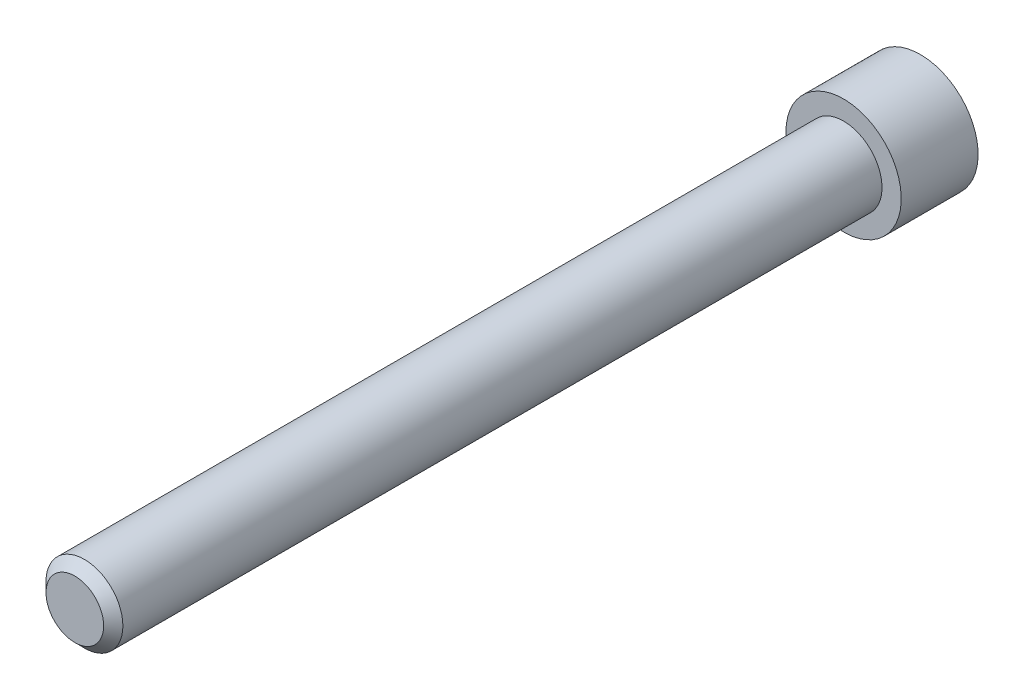
ISO-10303-21;
HEADER;
FILE_DESCRIPTION(('STEP AP214'),'2;1');
FILE_NAME('part.step','',(''),(''),'','','');
FILE_SCHEMA(('AUTOMOTIVE_DESIGN { 1 0 10303 214 1 1 1 1 }'));
ENDSEC;
DATA;
#1=APPLICATION_CONTEXT('core data for automotive mechanical design processes');
#2=APPLICATION_PROTOCOL_DEFINITION('international standard','automotive_design',2000,#1);
#3=PRODUCT_CONTEXT('',#1,'mechanical');
#4=PRODUCT('Part','Part','',(#3));
#5=PRODUCT_RELATED_PRODUCT_CATEGORY('part','',(#4));
#6=PRODUCT_DEFINITION_FORMATION('','',#4);
#7=PRODUCT_DEFINITION_CONTEXT('part definition',#1,'design');
#8=PRODUCT_DEFINITION('design','',#6,#7);
#9=PRODUCT_DEFINITION_SHAPE('','',#8);
#10=(LENGTH_UNIT() NAMED_UNIT(*) SI_UNIT(.MILLI.,.METRE.));
#11=(NAMED_UNIT(*) PLANE_ANGLE_UNIT() SI_UNIT($,.RADIAN.));
#12=(NAMED_UNIT(*) SI_UNIT($,.STERADIAN.) SOLID_ANGLE_UNIT());
#13=UNCERTAINTY_MEASURE_WITH_UNIT(LENGTH_MEASURE(1.E-05),#10,'distance_accuracy_value','');
#14=(GEOMETRIC_REPRESENTATION_CONTEXT(3) GLOBAL_UNCERTAINTY_ASSIGNED_CONTEXT((#13)) GLOBAL_UNIT_ASSIGNED_CONTEXT((#10,
#11,#12)) REPRESENTATION_CONTEXT('',''));
#15=CARTESIAN_POINT('',(0.,0.,0.));
#16=DIRECTION('',(0.,0.,1.));
#17=DIRECTION('',(1.,0.,0.));
#18=AXIS2_PLACEMENT_3D('',#15,#16,#17);
#19=CARTESIAN_POINT('',(0.,0.,200.));
#20=DIRECTION('',(0.,0.,-1.));
#21=DIRECTION('',(-1.,0.,0.));
#22=AXIS2_PLACEMENT_3D('',#19,#20,#21);
#23=CYLINDRICAL_SURFACE('',#22,10.);
#24=CARTESIAN_POINT('',(0.,0.,197.5));
#25=DIRECTION('',(0.,0.,1.));
#26=DIRECTION('',(1.,0.,0.));
#27=AXIS2_PLACEMENT_3D('',#24,#25,#26);
#28=CIRCLE('',#27,10.);
#29=CARTESIAN_POINT('',(10.,0.,197.5));
#30=VERTEX_POINT('',#29);
#31=EDGE_CURVE('E10',#30,#30,#28,.F.);
#32=ORIENTED_EDGE('',*,*,#31,.T.);
#33=EDGE_LOOP('',(#32));
#34=FACE_BOUND('',#33,.T.);
#35=CARTESIAN_POINT('',(0.,0.,0.));
#36=DIRECTION('',(0.,0.,-1.));
#37=DIRECTION('',(-1.,0.,0.));
#38=AXIS2_PLACEMENT_3D('',#35,#36,#37);
#39=CIRCLE('',#38,10.);
#40=CARTESIAN_POINT('',(-10.,0.,0.));
#41=VERTEX_POINT('',#40);
#42=EDGE_CURVE('E49',#41,#41,#39,.T.);
#43=ORIENTED_EDGE('',*,*,#42,.F.);
#44=EDGE_LOOP('',(#43));
#45=FACE_BOUND('',#44,.T.);
#46=ADVANCED_FACE('F38',(#34,#45),#23,.T.);
#47=CARTESIAN_POINT('',(0.,0.,200.));
#48=DIRECTION('',(0.,0.,1.));
#49=DIRECTION('',(1.,0.,0.));
#50=AXIS2_PLACEMENT_3D('',#47,#48,#49);
#51=PLANE('',#50);
#52=CARTESIAN_POINT('',(0.,0.,200.));
#53=DIRECTION('',(0.,0.,1.));
#54=DIRECTION('',(1.,0.,0.));
#55=AXIS2_PLACEMENT_3D('',#52,#53,#54);
#56=CIRCLE('',#55,7.5);
#57=CARTESIAN_POINT('',(7.5,0.,200.));
#58=VERTEX_POINT('',#57);
#59=EDGE_CURVE('E45',#58,#58,#56,.T.);
#60=ORIENTED_EDGE('',*,*,#59,.T.);
#61=EDGE_LOOP('',(#60));
#62=FACE_BOUND('',#61,.T.);
#63=ADVANCED_FACE('F73',(#62),#51,.T.);
#64=CARTESIAN_POINT('',(0.,0.,0.));
#65=DIRECTION('',(0.,0.,-1.));
#66=DIRECTION('',(-1.,0.,0.));
#67=AXIS2_PLACEMENT_3D('',#64,#65,#66);
#68=PLANE('',#67);
#69=CARTESIAN_POINT('',(0.,0.,0.));
#70=DIRECTION('',(0.,0.,-1.));
#71=DIRECTION('',(-1.,0.,0.));
#72=AXIS2_PLACEMENT_3D('',#69,#70,#71);
#73=CIRCLE('',#72,15.);
#74=CARTESIAN_POINT('',(-15.,0.,0.));
#75=VERTEX_POINT('',#74);
#76=EDGE_CURVE('E56',#75,#75,#73,.T.);
#77=ORIENTED_EDGE('',*,*,#76,.F.);
#78=EDGE_LOOP('',(#77));
#79=FACE_BOUND('',#78,.T.);
#80=ORIENTED_EDGE('',*,*,#42,.T.);
#81=EDGE_LOOP('',(#80));
#82=FACE_BOUND('',#81,.T.);
#83=ADVANCED_FACE('F67',(#79,#82),#68,.F.);
#84=CARTESIAN_POINT('',(0.,0.,-20.));
#85=DIRECTION('',(0.,0.,1.));
#86=DIRECTION('',(1.,0.,0.));
#87=AXIS2_PLACEMENT_3D('',#84,#85,#86);
#88=CYLINDRICAL_SURFACE('',#87,15.);
#89=CARTESIAN_POINT('',(0.,0.,-20.));
#90=DIRECTION('',(0.,0.,-1.));
#91=DIRECTION('',(-1.,0.,0.));
#92=AXIS2_PLACEMENT_3D('',#89,#90,#91);
#93=CIRCLE('',#92,15.);
#94=CARTESIAN_POINT('',(-15.,0.,-20.));
#95=VERTEX_POINT('',#94);
#96=EDGE_CURVE('E53',#95,#95,#93,.T.);
#97=ORIENTED_EDGE('',*,*,#96,.F.);
#98=EDGE_LOOP('',(#97));
#99=FACE_BOUND('',#98,.T.);
#100=ORIENTED_EDGE('',*,*,#76,.T.);
#101=EDGE_LOOP('',(#100));
#102=FACE_BOUND('',#101,.T.);
#103=ADVANCED_FACE('F64',(#99,#102),#88,.T.);
#104=CARTESIAN_POINT('',(0.,0.,-20.));
#105=DIRECTION('',(0.,0.,-1.));
#106=DIRECTION('',(-1.,0.,0.));
#107=AXIS2_PLACEMENT_3D('',#104,#105,#106);
#108=PLANE('',#107);
#109=ORIENTED_EDGE('',*,*,#96,.T.);
#110=EDGE_LOOP('',(#109));
#111=FACE_BOUND('',#110,.T.);
#112=ADVANCED_FACE('F62',(#111),#108,.T.);
#113=CARTESIAN_POINT('',(0.,0.,200.));
#114=DIRECTION('',(0.,0.,-1.));
#115=DIRECTION('',(-1.,0.,0.));
#116=AXIS2_PLACEMENT_3D('',#113,#114,#115);
#117=CONICAL_SURFACE('',#116,7.5,0.785398163397449);
#118=ORIENTED_EDGE('',*,*,#31,.F.);
#119=EDGE_LOOP('',(#118));
#120=FACE_BOUND('',#119,.T.);
#121=ORIENTED_EDGE('',*,*,#59,.F.);
#122=EDGE_LOOP('',(#121));
#123=FACE_BOUND('',#122,.T.);
#124=ADVANCED_FACE('F40',(#120,#123),#117,.T.);
#125=CLOSED_SHELL('',(#46,#63,#83,#103,#112,#124));
#126=MANIFOLD_SOLID_BREP('B2',#125);
#127=ADVANCED_BREP_SHAPE_REPRESENTATION('',(#18,#126),#14);
#128=SHAPE_DEFINITION_REPRESENTATION(#9,#127);
ENDSEC;
END-ISO-10303-21;
